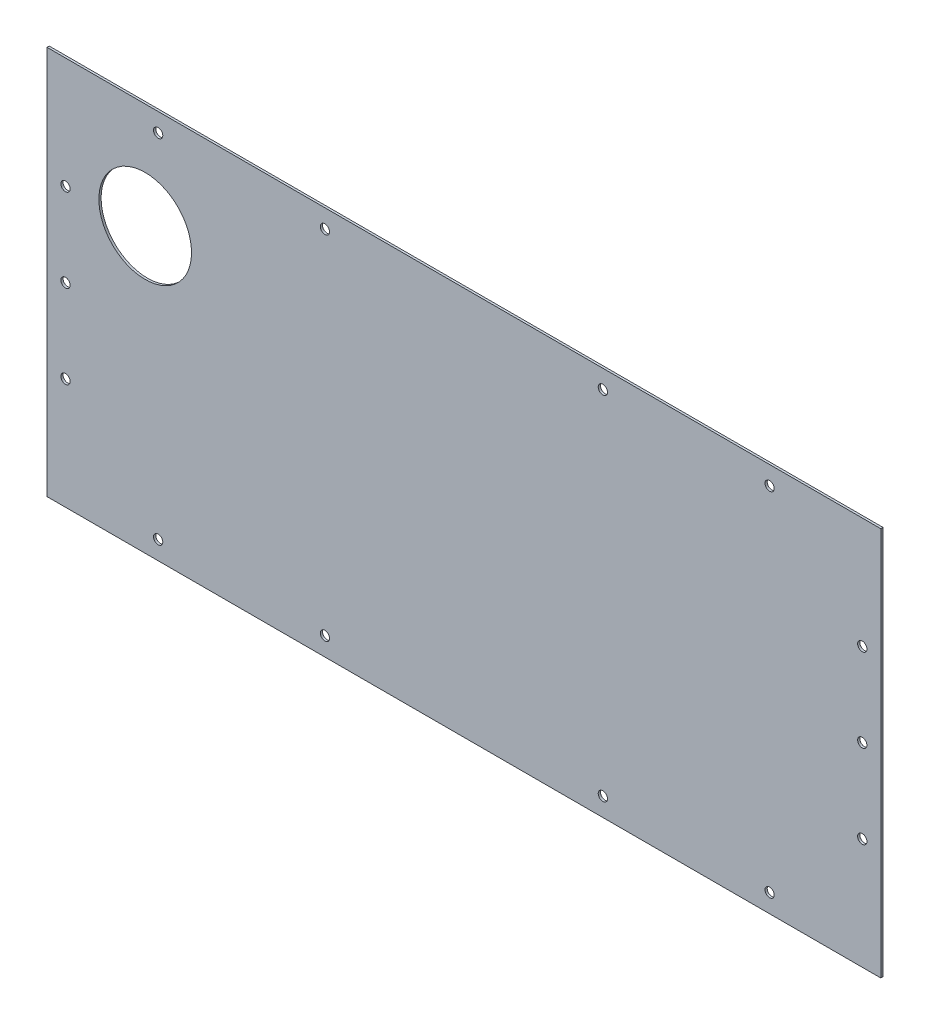
ISO-10303-21;
HEADER;
FILE_DESCRIPTION(('STEP AP214'),'2;1');
FILE_NAME('part.step','',(''),(''),'','','');
FILE_SCHEMA(('AUTOMOTIVE_DESIGN { 1 0 10303 214 1 1 1 1 }'));
ENDSEC;
DATA;
#1=APPLICATION_CONTEXT('core data for automotive mechanical design processes');
#2=APPLICATION_PROTOCOL_DEFINITION('international standard','automotive_design',2000,#1);
#3=PRODUCT_CONTEXT('',#1,'mechanical');
#4=PRODUCT('Part','Part','',(#3));
#5=PRODUCT_RELATED_PRODUCT_CATEGORY('part','',(#4));
#6=PRODUCT_DEFINITION_FORMATION('','',#4);
#7=PRODUCT_DEFINITION_CONTEXT('part definition',#1,'design');
#8=PRODUCT_DEFINITION('design','',#6,#7);
#9=PRODUCT_DEFINITION_SHAPE('','',#8);
#10=(LENGTH_UNIT() NAMED_UNIT(*) SI_UNIT(.MILLI.,.METRE.));
#11=(NAMED_UNIT(*) PLANE_ANGLE_UNIT() SI_UNIT($,.RADIAN.));
#12=(NAMED_UNIT(*) SI_UNIT($,.STERADIAN.) SOLID_ANGLE_UNIT());
#13=UNCERTAINTY_MEASURE_WITH_UNIT(LENGTH_MEASURE(1.E-05),#10,'distance_accuracy_value','');
#14=(GEOMETRIC_REPRESENTATION_CONTEXT(3) GLOBAL_UNCERTAINTY_ASSIGNED_CONTEXT((#13)) GLOBAL_UNIT_ASSIGNED_CONTEXT((#10,
#11,#12)) REPRESENTATION_CONTEXT('',''));
#15=CARTESIAN_POINT('',(0.,0.,0.));
#16=DIRECTION('',(0.,0.,1.));
#17=DIRECTION('',(1.,0.,0.));
#18=AXIS2_PLACEMENT_3D('',#15,#16,#17);
#19=CARTESIAN_POINT('',(0.,0.,0.));
#20=DIRECTION('',(-1.,0.,0.));
#21=DIRECTION('',(0.,1.,0.));
#22=AXIS2_PLACEMENT_3D('',#19,#20,#21);
#23=PLANE('',#22);
#24=DIRECTION('',(0.,0.,-1.));
#25=VECTOR('',#24,1.);
#26=CARTESIAN_POINT('',(0.,0.,0.));
#27=LINE('',#26,#25);
#28=CARTESIAN_POINT('',(0.,0.,0.));
#29=VERTEX_POINT('',#28);
#30=CARTESIAN_POINT('',(0.,0.,-1.2));
#31=VERTEX_POINT('',#30);
#32=EDGE_CURVE('E11',#29,#31,#27,.T.);
#33=ORIENTED_EDGE('',*,*,#32,.F.);
#34=DIRECTION('',(0.,1.,0.));
#35=VECTOR('',#34,1.);
#36=CARTESIAN_POINT('',(0.,0.,0.));
#37=LINE('',#36,#35);
#38=CARTESIAN_POINT('',(0.,210.,0.));
#39=VERTEX_POINT('',#38);
#40=EDGE_CURVE('E96',#29,#39,#37,.T.);
#41=ORIENTED_EDGE('',*,*,#40,.T.);
#42=DIRECTION('',(0.,0.,-1.));
#43=VECTOR('',#42,1.);
#44=CARTESIAN_POINT('',(0.,210.,0.));
#45=LINE('',#44,#43);
#46=CARTESIAN_POINT('',(0.,210.,-1.2));
#47=VERTEX_POINT('',#46);
#48=EDGE_CURVE('E45',#39,#47,#45,.T.);
#49=ORIENTED_EDGE('',*,*,#48,.T.);
#50=DIRECTION('',(0.,1.,0.));
#51=VECTOR('',#50,1.);
#52=CARTESIAN_POINT('',(0.,0.,-1.2));
#53=LINE('',#52,#51);
#54=EDGE_CURVE('E105',#31,#47,#53,.T.);
#55=ORIENTED_EDGE('',*,*,#54,.F.);
#56=EDGE_LOOP('',(#33,#41,#49,#55));
#57=FACE_BOUND('',#56,.T.);
#58=ADVANCED_FACE('F35',(#57),#23,.T.);
#59=CARTESIAN_POINT('',(0.,210.,0.));
#60=DIRECTION('',(0.,1.,0.));
#61=DIRECTION('',(1.,0.,0.));
#62=AXIS2_PLACEMENT_3D('',#59,#60,#61);
#63=PLANE('',#62);
#64=ORIENTED_EDGE('',*,*,#48,.F.);
#65=DIRECTION('',(1.,0.,0.));
#66=VECTOR('',#65,1.);
#67=CARTESIAN_POINT('',(0.,210.,0.));
#68=LINE('',#67,#66);
#69=CARTESIAN_POINT('',(450.,210.,0.));
#70=VERTEX_POINT('',#69);
#71=EDGE_CURVE('E91',#39,#70,#68,.T.);
#72=ORIENTED_EDGE('',*,*,#71,.T.);
#73=DIRECTION('',(0.,0.,-1.));
#74=VECTOR('',#73,1.);
#75=CARTESIAN_POINT('',(450.,210.,0.));
#76=LINE('',#75,#74);
#77=CARTESIAN_POINT('',(450.,210.,-1.2));
#78=VERTEX_POINT('',#77);
#79=EDGE_CURVE('E76',#70,#78,#76,.T.);
#80=ORIENTED_EDGE('',*,*,#79,.T.);
#81=DIRECTION('',(-1.,0.,0.));
#82=VECTOR('',#81,1.);
#83=CARTESIAN_POINT('',(0.,210.,-1.2));
#84=LINE('',#83,#82);
#85=EDGE_CURVE('E107',#47,#78,#84,.F.);
#86=ORIENTED_EDGE('',*,*,#85,.F.);
#87=EDGE_LOOP('',(#64,#72,#80,#86));
#88=FACE_BOUND('',#87,.T.);
#89=ADVANCED_FACE('F95',(#88),#63,.T.);
#90=CARTESIAN_POINT('',(450.,0.,0.));
#91=DIRECTION('',(-1.,0.,0.));
#92=DIRECTION('',(0.,1.,0.));
#93=AXIS2_PLACEMENT_3D('',#90,#91,#92);
#94=PLANE('',#93);
#95=ORIENTED_EDGE('',*,*,#79,.F.);
#96=DIRECTION('',(0.,1.,0.));
#97=VECTOR('',#96,1.);
#98=CARTESIAN_POINT('',(450.,0.,0.));
#99=LINE('',#98,#97);
#100=CARTESIAN_POINT('',(450.,0.,0.));
#101=VERTEX_POINT('',#100);
#102=EDGE_CURVE('E79',#101,#70,#99,.T.);
#103=ORIENTED_EDGE('',*,*,#102,.F.);
#104=DIRECTION('',(0.,0.,-1.));
#105=VECTOR('',#104,1.);
#106=CARTESIAN_POINT('',(450.,0.,0.));
#107=LINE('',#106,#105);
#108=CARTESIAN_POINT('',(450.,0.,-1.2));
#109=VERTEX_POINT('',#108);
#110=EDGE_CURVE('E39',#101,#109,#107,.T.);
#111=ORIENTED_EDGE('',*,*,#110,.T.);
#112=DIRECTION('',(0.,1.,0.));
#113=VECTOR('',#112,1.);
#114=CARTESIAN_POINT('',(450.,0.,-1.2));
#115=LINE('',#114,#113);
#116=EDGE_CURVE('E81',#109,#78,#115,.T.);
#117=ORIENTED_EDGE('',*,*,#116,.T.);
#118=EDGE_LOOP('',(#95,#103,#111,#117));
#119=FACE_BOUND('',#118,.T.);
#120=ADVANCED_FACE('F78',(#119),#94,.F.);
#121=CARTESIAN_POINT('',(0.,0.,0.));
#122=DIRECTION('',(0.,1.,0.));
#123=DIRECTION('',(1.,0.,0.));
#124=AXIS2_PLACEMENT_3D('',#121,#122,#123);
#125=PLANE('',#124);
#126=DIRECTION('',(1.,0.,0.));
#127=VECTOR('',#126,1.);
#128=CARTESIAN_POINT('',(0.,0.,0.));
#129=LINE('',#128,#127);
#130=EDGE_CURVE('E92',#29,#101,#129,.T.);
#131=ORIENTED_EDGE('',*,*,#130,.F.);
#132=ORIENTED_EDGE('',*,*,#32,.T.);
#133=DIRECTION('',(-1.,0.,0.));
#134=VECTOR('',#133,1.);
#135=CARTESIAN_POINT('',(0.,0.,-1.2));
#136=LINE('',#135,#134);
#137=EDGE_CURVE('E98',#31,#109,#136,.F.);
#138=ORIENTED_EDGE('',*,*,#137,.T.);
#139=ORIENTED_EDGE('',*,*,#110,.F.);
#140=EDGE_LOOP('',(#131,#132,#138,#139));
#141=FACE_BOUND('',#140,.T.);
#142=ADVANCED_FACE('F37',(#141),#125,.F.);
#143=CARTESIAN_POINT('',(0.,0.,-1.2));
#144=DIRECTION('',(0.,0.,-1.));
#145=DIRECTION('',(-1.,0.,0.));
#146=AXIS2_PLACEMENT_3D('',#143,#144,#145);
#147=PLANE('',#146);
#148=CARTESIAN_POINT('',(440.,150.,-1.2));
#149=DIRECTION('',(0.,0.,-1.));
#150=DIRECTION('',(-1.,0.,0.));
#151=AXIS2_PLACEMENT_3D('',#148,#149,#150);
#152=CIRCLE('',#151,2.50000000000002);
#153=CARTESIAN_POINT('',(437.5,150.,-1.2));
#154=VERTEX_POINT('',#153);
#155=EDGE_CURVE('E114',#154,#154,#152,.T.);
#156=ORIENTED_EDGE('',*,*,#155,.F.);
#157=EDGE_LOOP('',(#156));
#158=FACE_BOUND('',#157,.T.);
#159=CARTESIAN_POINT('',(60.,200.,-1.2));
#160=DIRECTION('',(0.,0.,-1.));
#161=DIRECTION('',(-1.,0.,0.));
#162=AXIS2_PLACEMENT_3D('',#159,#160,#161);
#163=CIRCLE('',#162,2.5);
#164=CARTESIAN_POINT('',(57.5,200.,-1.2));
#165=VERTEX_POINT('',#164);
#166=EDGE_CURVE('E117',#165,#165,#163,.T.);
#167=ORIENTED_EDGE('',*,*,#166,.F.);
#168=EDGE_LOOP('',(#167));
#169=FACE_BOUND('',#168,.T.);
#170=CARTESIAN_POINT('',(150.,200.,-1.2));
#171=DIRECTION('',(0.,0.,-1.));
#172=DIRECTION('',(-1.,0.,0.));
#173=AXIS2_PLACEMENT_3D('',#170,#171,#172);
#174=CIRCLE('',#173,2.5);
#175=CARTESIAN_POINT('',(147.5,200.,-1.2));
#176=VERTEX_POINT('',#175);
#177=EDGE_CURVE('E120',#176,#176,#174,.T.);
#178=ORIENTED_EDGE('',*,*,#177,.F.);
#179=EDGE_LOOP('',(#178));
#180=FACE_BOUND('',#179,.T.);
#181=CARTESIAN_POINT('',(390.,10.0000000000001,-1.2));
#182=DIRECTION('',(0.,0.,-1.));
#183=DIRECTION('',(-1.,0.,0.));
#184=AXIS2_PLACEMENT_3D('',#181,#182,#183);
#185=CIRCLE('',#184,2.49999999999996);
#186=CARTESIAN_POINT('',(387.5,10.0000000000001,-1.2));
#187=VERTEX_POINT('',#186);
#188=EDGE_CURVE('E123',#187,#187,#185,.T.);
#189=ORIENTED_EDGE('',*,*,#188,.F.);
#190=EDGE_LOOP('',(#189));
#191=FACE_BOUND('',#190,.T.);
#192=CARTESIAN_POINT('',(440.,105.,-1.2));
#193=DIRECTION('',(0.,0.,-1.));
#194=DIRECTION('',(-1.,0.,0.));
#195=AXIS2_PLACEMENT_3D('',#192,#193,#194);
#196=CIRCLE('',#195,2.50000000000002);
#197=CARTESIAN_POINT('',(437.5,105.,-1.2));
#198=VERTEX_POINT('',#197);
#199=EDGE_CURVE('E126',#198,#198,#196,.T.);
#200=ORIENTED_EDGE('',*,*,#199,.F.);
#201=EDGE_LOOP('',(#200));
#202=FACE_BOUND('',#201,.T.);
#203=CARTESIAN_POINT('',(440.,60.0000000000001,-1.2));
#204=DIRECTION('',(0.,0.,-1.));
#205=DIRECTION('',(-1.,0.,0.));
#206=AXIS2_PLACEMENT_3D('',#203,#204,#205);
#207=CIRCLE('',#206,2.50000000000002);
#208=CARTESIAN_POINT('',(437.5,60.0000000000001,-1.2));
#209=VERTEX_POINT('',#208);
#210=EDGE_CURVE('E129',#209,#209,#207,.T.);
#211=ORIENTED_EDGE('',*,*,#210,.F.);
#212=EDGE_LOOP('',(#211));
#213=FACE_BOUND('',#212,.T.);
#214=CARTESIAN_POINT('',(10.,150.,-1.2));
#215=DIRECTION('',(0.,0.,-1.));
#216=DIRECTION('',(-1.,0.,0.));
#217=AXIS2_PLACEMENT_3D('',#214,#215,#216);
#218=CIRCLE('',#217,2.5);
#219=CARTESIAN_POINT('',(7.5,150.,-1.2));
#220=VERTEX_POINT('',#219);
#221=EDGE_CURVE('E132',#220,#220,#218,.T.);
#222=ORIENTED_EDGE('',*,*,#221,.F.);
#223=EDGE_LOOP('',(#222));
#224=FACE_BOUND('',#223,.T.);
#225=CARTESIAN_POINT('',(10.,105.,-1.2));
#226=DIRECTION('',(0.,0.,-1.));
#227=DIRECTION('',(-1.,0.,0.));
#228=AXIS2_PLACEMENT_3D('',#225,#226,#227);
#229=CIRCLE('',#228,2.5);
#230=CARTESIAN_POINT('',(7.5,105.,-1.2));
#231=VERTEX_POINT('',#230);
#232=EDGE_CURVE('E135',#231,#231,#229,.T.);
#233=ORIENTED_EDGE('',*,*,#232,.F.);
#234=EDGE_LOOP('',(#233));
#235=FACE_BOUND('',#234,.T.);
#236=CARTESIAN_POINT('',(300.,200.,-1.2));
#237=DIRECTION('',(0.,0.,-1.));
#238=DIRECTION('',(-1.,0.,0.));
#239=AXIS2_PLACEMENT_3D('',#236,#237,#238);
#240=CIRCLE('',#239,2.50000000000002);
#241=CARTESIAN_POINT('',(297.5,200.,-1.2));
#242=VERTEX_POINT('',#241);
#243=EDGE_CURVE('E138',#242,#242,#240,.T.);
#244=ORIENTED_EDGE('',*,*,#243,.F.);
#245=EDGE_LOOP('',(#244));
#246=FACE_BOUND('',#245,.T.);
#247=CARTESIAN_POINT('',(390.,200.,-1.2));
#248=DIRECTION('',(0.,0.,-1.));
#249=DIRECTION('',(-1.,0.,0.));
#250=AXIS2_PLACEMENT_3D('',#247,#248,#249);
#251=CIRCLE('',#250,2.49999999999996);
#252=CARTESIAN_POINT('',(387.5,200.,-1.2));
#253=VERTEX_POINT('',#252);
#254=EDGE_CURVE('E141',#253,#253,#251,.T.);
#255=ORIENTED_EDGE('',*,*,#254,.F.);
#256=EDGE_LOOP('',(#255));
#257=FACE_BOUND('',#256,.T.);
#258=CARTESIAN_POINT('',(300.,10.0000000000001,-1.2));
#259=DIRECTION('',(0.,0.,-1.));
#260=DIRECTION('',(-1.,0.,0.));
#261=AXIS2_PLACEMENT_3D('',#258,#259,#260);
#262=CIRCLE('',#261,2.50000000000002);
#263=CARTESIAN_POINT('',(297.5,10.0000000000001,-1.2));
#264=VERTEX_POINT('',#263);
#265=EDGE_CURVE('E144',#264,#264,#262,.T.);
#266=ORIENTED_EDGE('',*,*,#265,.F.);
#267=EDGE_LOOP('',(#266));
#268=FACE_BOUND('',#267,.T.);
#269=CARTESIAN_POINT('',(150.,10.,-1.2));
#270=DIRECTION('',(0.,0.,-1.));
#271=DIRECTION('',(-1.,0.,0.));
#272=AXIS2_PLACEMENT_3D('',#269,#270,#271);
#273=CIRCLE('',#272,2.5);
#274=CARTESIAN_POINT('',(147.5,10.,-1.2));
#275=VERTEX_POINT('',#274);
#276=EDGE_CURVE('E147',#275,#275,#273,.T.);
#277=ORIENTED_EDGE('',*,*,#276,.F.);
#278=EDGE_LOOP('',(#277));
#279=FACE_BOUND('',#278,.T.);
#280=CARTESIAN_POINT('',(60.,10.,-1.2));
#281=DIRECTION('',(0.,0.,-1.));
#282=DIRECTION('',(-1.,0.,0.));
#283=AXIS2_PLACEMENT_3D('',#280,#281,#282);
#284=CIRCLE('',#283,2.5);
#285=CARTESIAN_POINT('',(57.5,10.,-1.2));
#286=VERTEX_POINT('',#285);
#287=EDGE_CURVE('E150',#286,#286,#284,.T.);
#288=ORIENTED_EDGE('',*,*,#287,.F.);
#289=EDGE_LOOP('',(#288));
#290=FACE_BOUND('',#289,.T.);
#291=CARTESIAN_POINT('',(10.,60.,-1.2));
#292=DIRECTION('',(0.,0.,-1.));
#293=DIRECTION('',(-1.,0.,0.));
#294=AXIS2_PLACEMENT_3D('',#291,#292,#293);
#295=CIRCLE('',#294,2.5);
#296=CARTESIAN_POINT('',(7.5,60.,-1.2));
#297=VERTEX_POINT('',#296);
#298=EDGE_CURVE('E153',#297,#297,#295,.T.);
#299=ORIENTED_EDGE('',*,*,#298,.F.);
#300=EDGE_LOOP('',(#299));
#301=FACE_BOUND('',#300,.T.);
#302=CARTESIAN_POINT('',(53.,153.,-1.2));
#303=DIRECTION('',(0.,0.,-1.));
#304=DIRECTION('',(-1.,0.,0.));
#305=AXIS2_PLACEMENT_3D('',#302,#303,#304);
#306=CIRCLE('',#305,25.);
#307=CARTESIAN_POINT('',(28.,153.,-1.2));
#308=VERTEX_POINT('',#307);
#309=EDGE_CURVE('E93',#308,#308,#306,.T.);
#310=ORIENTED_EDGE('',*,*,#309,.F.);
#311=EDGE_LOOP('',(#310));
#312=FACE_BOUND('',#311,.T.);
#313=ORIENTED_EDGE('',*,*,#116,.F.);
#314=ORIENTED_EDGE('',*,*,#137,.F.);
#315=ORIENTED_EDGE('',*,*,#54,.T.);
#316=ORIENTED_EDGE('',*,*,#85,.T.);
#317=EDGE_LOOP('',(#313,#314,#315,#316));
#318=FACE_BOUND('',#317,.T.);
#319=ADVANCED_FACE('F204',(#158,#169,#180,#191,#202,#213,#224,#235,#246,#257,#268,#279,#290,
#301,#312,#318),#147,.T.);
#320=CARTESIAN_POINT('',(0.,0.,0.));
#321=DIRECTION('',(0.,0.,-1.));
#322=DIRECTION('',(-1.,0.,0.));
#323=AXIS2_PLACEMENT_3D('',#320,#321,#322);
#324=PLANE('',#323);
#325=CARTESIAN_POINT('',(440.,150.,0.));
#326=DIRECTION('',(0.,0.,1.));
#327=DIRECTION('',(-1.,0.,0.));
#328=AXIS2_PLACEMENT_3D('',#325,#326,#327);
#329=CIRCLE('',#328,2.50000000000002);
#330=CARTESIAN_POINT('',(437.5,150.,0.));
#331=VERTEX_POINT('',#330);
#332=EDGE_CURVE('E164',#331,#331,#329,.T.);
#333=ORIENTED_EDGE('',*,*,#332,.F.);
#334=EDGE_LOOP('',(#333));
#335=FACE_BOUND('',#334,.T.);
#336=CARTESIAN_POINT('',(60.,200.,0.));
#337=DIRECTION('',(0.,0.,1.));
#338=DIRECTION('',(1.,0.,0.));
#339=AXIS2_PLACEMENT_3D('',#336,#337,#338);
#340=CIRCLE('',#339,2.5);
#341=CARTESIAN_POINT('',(62.5,200.,0.));
#342=VERTEX_POINT('',#341);
#343=EDGE_CURVE('E172',#342,#342,#340,.T.);
#344=ORIENTED_EDGE('',*,*,#343,.F.);
#345=EDGE_LOOP('',(#344));
#346=FACE_BOUND('',#345,.T.);
#347=CARTESIAN_POINT('',(150.,200.,0.));
#348=DIRECTION('',(0.,0.,1.));
#349=DIRECTION('',(1.,0.,0.));
#350=AXIS2_PLACEMENT_3D('',#347,#348,#349);
#351=CIRCLE('',#350,2.5);
#352=CARTESIAN_POINT('',(152.5,200.,0.));
#353=VERTEX_POINT('',#352);
#354=EDGE_CURVE('E175',#353,#353,#351,.T.);
#355=ORIENTED_EDGE('',*,*,#354,.F.);
#356=EDGE_LOOP('',(#355));
#357=FACE_BOUND('',#356,.T.);
#358=CARTESIAN_POINT('',(390.,10.0000000000001,0.));
#359=DIRECTION('',(0.,0.,1.));
#360=DIRECTION('',(1.,0.,0.));
#361=AXIS2_PLACEMENT_3D('',#358,#359,#360);
#362=CIRCLE('',#361,2.49999999999996);
#363=CARTESIAN_POINT('',(392.5,10.0000000000001,0.));
#364=VERTEX_POINT('',#363);
#365=EDGE_CURVE('E178',#364,#364,#362,.T.);
#366=ORIENTED_EDGE('',*,*,#365,.F.);
#367=EDGE_LOOP('',(#366));
#368=FACE_BOUND('',#367,.T.);
#369=CARTESIAN_POINT('',(440.,105.,0.));
#370=DIRECTION('',(0.,0.,1.));
#371=DIRECTION('',(-1.,0.,0.));
#372=AXIS2_PLACEMENT_3D('',#369,#370,#371);
#373=CIRCLE('',#372,2.50000000000002);
#374=CARTESIAN_POINT('',(437.5,105.,0.));
#375=VERTEX_POINT('',#374);
#376=EDGE_CURVE('E160',#375,#375,#373,.T.);
#377=ORIENTED_EDGE('',*,*,#376,.F.);
#378=EDGE_LOOP('',(#377));
#379=FACE_BOUND('',#378,.T.);
#380=CARTESIAN_POINT('',(440.,60.0000000000001,0.));
#381=DIRECTION('',(0.,0.,1.));
#382=DIRECTION('',(-1.,0.,0.));
#383=AXIS2_PLACEMENT_3D('',#380,#381,#382);
#384=CIRCLE('',#383,2.50000000000002);
#385=CARTESIAN_POINT('',(437.5,60.0000000000001,0.));
#386=VERTEX_POINT('',#385);
#387=EDGE_CURVE('E163',#386,#386,#384,.T.);
#388=ORIENTED_EDGE('',*,*,#387,.F.);
#389=EDGE_LOOP('',(#388));
#390=FACE_BOUND('',#389,.T.);
#391=CARTESIAN_POINT('',(10.,150.,0.));
#392=DIRECTION('',(0.,0.,1.));
#393=DIRECTION('',(1.,0.,0.));
#394=AXIS2_PLACEMENT_3D('',#391,#392,#393);
#395=CIRCLE('',#394,2.5);
#396=CARTESIAN_POINT('',(12.5,150.,0.));
#397=VERTEX_POINT('',#396);
#398=EDGE_CURVE('E167',#397,#397,#395,.T.);
#399=ORIENTED_EDGE('',*,*,#398,.F.);
#400=EDGE_LOOP('',(#399));
#401=FACE_BOUND('',#400,.T.);
#402=CARTESIAN_POINT('',(10.,105.,0.));
#403=DIRECTION('',(0.,0.,1.));
#404=DIRECTION('',(1.,0.,0.));
#405=AXIS2_PLACEMENT_3D('',#402,#403,#404);
#406=CIRCLE('',#405,2.5);
#407=CARTESIAN_POINT('',(12.5,105.,0.));
#408=VERTEX_POINT('',#407);
#409=EDGE_CURVE('E159',#408,#408,#406,.T.);
#410=ORIENTED_EDGE('',*,*,#409,.F.);
#411=EDGE_LOOP('',(#410));
#412=FACE_BOUND('',#411,.T.);
#413=CARTESIAN_POINT('',(300.,200.,0.));
#414=DIRECTION('',(0.,0.,1.));
#415=DIRECTION('',(-1.,0.,0.));
#416=AXIS2_PLACEMENT_3D('',#413,#414,#415);
#417=CIRCLE('',#416,2.50000000000002);
#418=CARTESIAN_POINT('',(297.5,200.,0.));
#419=VERTEX_POINT('',#418);
#420=EDGE_CURVE('E181',#419,#419,#417,.T.);
#421=ORIENTED_EDGE('',*,*,#420,.F.);
#422=EDGE_LOOP('',(#421));
#423=FACE_BOUND('',#422,.T.);
#424=CARTESIAN_POINT('',(390.,200.,0.));
#425=DIRECTION('',(0.,0.,1.));
#426=DIRECTION('',(-1.,0.,0.));
#427=AXIS2_PLACEMENT_3D('',#424,#425,#426);
#428=CIRCLE('',#427,2.49999999999996);
#429=CARTESIAN_POINT('',(387.5,200.,0.));
#430=VERTEX_POINT('',#429);
#431=EDGE_CURVE('E193',#430,#430,#428,.T.);
#432=ORIENTED_EDGE('',*,*,#431,.F.);
#433=EDGE_LOOP('',(#432));
#434=FACE_BOUND('',#433,.T.);
#435=CARTESIAN_POINT('',(300.,10.0000000000001,0.));
#436=DIRECTION('',(0.,0.,1.));
#437=DIRECTION('',(1.,0.,0.));
#438=AXIS2_PLACEMENT_3D('',#435,#436,#437);
#439=CIRCLE('',#438,2.50000000000002);
#440=CARTESIAN_POINT('',(302.5,10.0000000000001,0.));
#441=VERTEX_POINT('',#440);
#442=EDGE_CURVE('E190',#441,#441,#439,.T.);
#443=ORIENTED_EDGE('',*,*,#442,.F.);
#444=EDGE_LOOP('',(#443));
#445=FACE_BOUND('',#444,.T.);
#446=CARTESIAN_POINT('',(150.,10.,0.));
#447=DIRECTION('',(0.,0.,1.));
#448=DIRECTION('',(-1.,0.,0.));
#449=AXIS2_PLACEMENT_3D('',#446,#447,#448);
#450=CIRCLE('',#449,2.5);
#451=CARTESIAN_POINT('',(147.5,10.,0.));
#452=VERTEX_POINT('',#451);
#453=EDGE_CURVE('E187',#452,#452,#450,.T.);
#454=ORIENTED_EDGE('',*,*,#453,.F.);
#455=EDGE_LOOP('',(#454));
#456=FACE_BOUND('',#455,.T.);
#457=CARTESIAN_POINT('',(60.,10.,0.));
#458=DIRECTION('',(0.,0.,1.));
#459=DIRECTION('',(-1.,0.,0.));
#460=AXIS2_PLACEMENT_3D('',#457,#458,#459);
#461=CIRCLE('',#460,2.5);
#462=CARTESIAN_POINT('',(57.5,10.,0.));
#463=VERTEX_POINT('',#462);
#464=EDGE_CURVE('E184',#463,#463,#461,.T.);
#465=ORIENTED_EDGE('',*,*,#464,.F.);
#466=EDGE_LOOP('',(#465));
#467=FACE_BOUND('',#466,.T.);
#468=CARTESIAN_POINT('',(10.,60.,0.));
#469=DIRECTION('',(0.,0.,1.));
#470=DIRECTION('',(1.,0.,0.));
#471=AXIS2_PLACEMENT_3D('',#468,#469,#470);
#472=CIRCLE('',#471,2.5);
#473=CARTESIAN_POINT('',(12.5,60.,0.));
#474=VERTEX_POINT('',#473);
#475=EDGE_CURVE('E156',#474,#474,#472,.T.);
#476=ORIENTED_EDGE('',*,*,#475,.F.);
#477=EDGE_LOOP('',(#476));
#478=FACE_BOUND('',#477,.T.);
#479=CARTESIAN_POINT('',(53.,153.,0.));
#480=DIRECTION('',(0.,0.,1.));
#481=DIRECTION('',(1.,0.,0.));
#482=AXIS2_PLACEMENT_3D('',#479,#480,#481);
#483=CIRCLE('',#482,25.);
#484=CARTESIAN_POINT('',(78.,153.,0.));
#485=VERTEX_POINT('',#484);
#486=EDGE_CURVE('E111',#485,#485,#483,.T.);
#487=ORIENTED_EDGE('',*,*,#486,.F.);
#488=EDGE_LOOP('',(#487));
#489=FACE_BOUND('',#488,.T.);
#490=ORIENTED_EDGE('',*,*,#102,.T.);
#491=ORIENTED_EDGE('',*,*,#71,.F.);
#492=ORIENTED_EDGE('',*,*,#40,.F.);
#493=ORIENTED_EDGE('',*,*,#130,.T.);
#494=EDGE_LOOP('',(#490,#491,#492,#493));
#495=FACE_BOUND('',#494,.T.);
#496=ADVANCED_FACE('F89',(#335,#346,#357,#368,#379,#390,#401,#412,#423,#434,#445,#456,#467,#478,
#489,#495),#324,.F.);
#497=CARTESIAN_POINT('',(53.,153.,-10.));
#498=DIRECTION('',(0.,0.,1.));
#499=DIRECTION('',(1.,0.,0.));
#500=AXIS2_PLACEMENT_3D('',#497,#498,#499);
#501=CYLINDRICAL_SURFACE('',#500,25.);
#502=ORIENTED_EDGE('',*,*,#309,.T.);
#503=EDGE_LOOP('',(#502));
#504=FACE_BOUND('',#503,.T.);
#505=ORIENTED_EDGE('',*,*,#486,.T.);
#506=EDGE_LOOP('',(#505));
#507=FACE_BOUND('',#506,.T.);
#508=ADVANCED_FACE('F203',(#504,#507),#501,.F.);
#509=CARTESIAN_POINT('',(10.,60.,-10.));
#510=DIRECTION('',(0.,0.,1.));
#511=DIRECTION('',(1.,0.,0.));
#512=AXIS2_PLACEMENT_3D('',#509,#510,#511);
#513=CYLINDRICAL_SURFACE('',#512,2.5);
#514=ORIENTED_EDGE('',*,*,#298,.T.);
#515=EDGE_LOOP('',(#514));
#516=FACE_BOUND('',#515,.T.);
#517=ORIENTED_EDGE('',*,*,#475,.T.);
#518=EDGE_LOOP('',(#517));
#519=FACE_BOUND('',#518,.T.);
#520=ADVANCED_FACE('F220',(#516,#519),#513,.F.);
#521=CARTESIAN_POINT('',(60.,10.,-10.));
#522=DIRECTION('',(0.,0.,1.));
#523=DIRECTION('',(1.,0.,0.));
#524=AXIS2_PLACEMENT_3D('',#521,#522,#523);
#525=CYLINDRICAL_SURFACE('',#524,2.5);
#526=ORIENTED_EDGE('',*,*,#287,.T.);
#527=EDGE_LOOP('',(#526));
#528=FACE_BOUND('',#527,.T.);
#529=ORIENTED_EDGE('',*,*,#464,.T.);
#530=EDGE_LOOP('',(#529));
#531=FACE_BOUND('',#530,.T.);
#532=ADVANCED_FACE('F226',(#528,#531),#525,.F.);
#533=CARTESIAN_POINT('',(150.,10.,-10.));
#534=DIRECTION('',(0.,0.,1.));
#535=DIRECTION('',(1.,0.,0.));
#536=AXIS2_PLACEMENT_3D('',#533,#534,#535);
#537=CYLINDRICAL_SURFACE('',#536,2.5);
#538=ORIENTED_EDGE('',*,*,#276,.T.);
#539=EDGE_LOOP('',(#538));
#540=FACE_BOUND('',#539,.T.);
#541=ORIENTED_EDGE('',*,*,#453,.T.);
#542=EDGE_LOOP('',(#541));
#543=FACE_BOUND('',#542,.T.);
#544=ADVANCED_FACE('F277',(#540,#543),#537,.F.);
#545=CARTESIAN_POINT('',(300.,10.0000000000001,-10.));
#546=DIRECTION('',(0.,0.,1.));
#547=DIRECTION('',(1.,0.,0.));
#548=AXIS2_PLACEMENT_3D('',#545,#546,#547);
#549=CYLINDRICAL_SURFACE('',#548,2.50000000000002);
#550=ORIENTED_EDGE('',*,*,#265,.T.);
#551=EDGE_LOOP('',(#550));
#552=FACE_BOUND('',#551,.T.);
#553=ORIENTED_EDGE('',*,*,#442,.T.);
#554=EDGE_LOOP('',(#553));
#555=FACE_BOUND('',#554,.T.);
#556=ADVANCED_FACE('F282',(#552,#555),#549,.F.);
#557=CARTESIAN_POINT('',(390.,200.,-10.));
#558=DIRECTION('',(0.,0.,1.));
#559=DIRECTION('',(1.,0.,0.));
#560=AXIS2_PLACEMENT_3D('',#557,#558,#559);
#561=CYLINDRICAL_SURFACE('',#560,2.49999999999996);
#562=ORIENTED_EDGE('',*,*,#254,.T.);
#563=EDGE_LOOP('',(#562));
#564=FACE_BOUND('',#563,.T.);
#565=ORIENTED_EDGE('',*,*,#431,.T.);
#566=EDGE_LOOP('',(#565));
#567=FACE_BOUND('',#566,.T.);
#568=ADVANCED_FACE('F382',(#564,#567),#561,.F.);
#569=CARTESIAN_POINT('',(300.,200.,-10.));
#570=DIRECTION('',(0.,0.,1.));
#571=DIRECTION('',(1.,0.,0.));
#572=AXIS2_PLACEMENT_3D('',#569,#570,#571);
#573=CYLINDRICAL_SURFACE('',#572,2.50000000000002);
#574=ORIENTED_EDGE('',*,*,#243,.T.);
#575=EDGE_LOOP('',(#574));
#576=FACE_BOUND('',#575,.T.);
#577=ORIENTED_EDGE('',*,*,#420,.T.);
#578=EDGE_LOOP('',(#577));
#579=FACE_BOUND('',#578,.T.);
#580=ADVANCED_FACE('F199',(#576,#579),#573,.F.);
#581=CARTESIAN_POINT('',(10.,105.,-10.));
#582=DIRECTION('',(0.,0.,1.));
#583=DIRECTION('',(1.,0.,0.));
#584=AXIS2_PLACEMENT_3D('',#581,#582,#583);
#585=CYLINDRICAL_SURFACE('',#584,2.5);
#586=ORIENTED_EDGE('',*,*,#232,.T.);
#587=EDGE_LOOP('',(#586));
#588=FACE_BOUND('',#587,.T.);
#589=ORIENTED_EDGE('',*,*,#409,.T.);
#590=EDGE_LOOP('',(#589));
#591=FACE_BOUND('',#590,.T.);
#592=ADVANCED_FACE('F304',(#588,#591),#585,.F.);
#593=CARTESIAN_POINT('',(10.,150.,-10.));
#594=DIRECTION('',(0.,0.,1.));
#595=DIRECTION('',(1.,0.,0.));
#596=AXIS2_PLACEMENT_3D('',#593,#594,#595);
#597=CYLINDRICAL_SURFACE('',#596,2.5);
#598=ORIENTED_EDGE('',*,*,#221,.T.);
#599=EDGE_LOOP('',(#598));
#600=FACE_BOUND('',#599,.T.);
#601=ORIENTED_EDGE('',*,*,#398,.T.);
#602=EDGE_LOOP('',(#601));
#603=FACE_BOUND('',#602,.T.);
#604=ADVANCED_FACE('F307',(#600,#603),#597,.F.);
#605=CARTESIAN_POINT('',(440.,60.0000000000001,-10.));
#606=DIRECTION('',(0.,0.,1.));
#607=DIRECTION('',(1.,0.,0.));
#608=AXIS2_PLACEMENT_3D('',#605,#606,#607);
#609=CYLINDRICAL_SURFACE('',#608,2.50000000000002);
#610=ORIENTED_EDGE('',*,*,#210,.T.);
#611=EDGE_LOOP('',(#610));
#612=FACE_BOUND('',#611,.T.);
#613=ORIENTED_EDGE('',*,*,#387,.T.);
#614=EDGE_LOOP('',(#613));
#615=FACE_BOUND('',#614,.T.);
#616=ADVANCED_FACE('F311',(#612,#615),#609,.F.);
#617=CARTESIAN_POINT('',(440.,105.,-10.));
#618=DIRECTION('',(0.,0.,1.));
#619=DIRECTION('',(1.,0.,0.));
#620=AXIS2_PLACEMENT_3D('',#617,#618,#619);
#621=CYLINDRICAL_SURFACE('',#620,2.50000000000002);
#622=ORIENTED_EDGE('',*,*,#199,.T.);
#623=EDGE_LOOP('',(#622));
#624=FACE_BOUND('',#623,.T.);
#625=ORIENTED_EDGE('',*,*,#376,.T.);
#626=EDGE_LOOP('',(#625));
#627=FACE_BOUND('',#626,.T.);
#628=ADVANCED_FACE('F295',(#624,#627),#621,.F.);
#629=CARTESIAN_POINT('',(390.,10.0000000000001,-10.));
#630=DIRECTION('',(0.,0.,1.));
#631=DIRECTION('',(1.,0.,0.));
#632=AXIS2_PLACEMENT_3D('',#629,#630,#631);
#633=CYLINDRICAL_SURFACE('',#632,2.49999999999996);
#634=ORIENTED_EDGE('',*,*,#188,.T.);
#635=EDGE_LOOP('',(#634));
#636=FACE_BOUND('',#635,.T.);
#637=ORIENTED_EDGE('',*,*,#365,.T.);
#638=EDGE_LOOP('',(#637));
#639=FACE_BOUND('',#638,.T.);
#640=ADVANCED_FACE('F291',(#636,#639),#633,.F.);
#641=CARTESIAN_POINT('',(150.,200.,-10.));
#642=DIRECTION('',(0.,0.,1.));
#643=DIRECTION('',(1.,0.,0.));
#644=AXIS2_PLACEMENT_3D('',#641,#642,#643);
#645=CYLINDRICAL_SURFACE('',#644,2.5);
#646=ORIENTED_EDGE('',*,*,#177,.T.);
#647=EDGE_LOOP('',(#646));
#648=FACE_BOUND('',#647,.T.);
#649=ORIENTED_EDGE('',*,*,#354,.T.);
#650=EDGE_LOOP('',(#649));
#651=FACE_BOUND('',#650,.T.);
#652=ADVANCED_FACE('F287',(#648,#651),#645,.F.);
#653=CARTESIAN_POINT('',(60.,200.,-10.));
#654=DIRECTION('',(0.,0.,1.));
#655=DIRECTION('',(1.,0.,0.));
#656=AXIS2_PLACEMENT_3D('',#653,#654,#655);
#657=CYLINDRICAL_SURFACE('',#656,2.5);
#658=ORIENTED_EDGE('',*,*,#166,.T.);
#659=EDGE_LOOP('',(#658));
#660=FACE_BOUND('',#659,.T.);
#661=ORIENTED_EDGE('',*,*,#343,.T.);
#662=EDGE_LOOP('',(#661));
#663=FACE_BOUND('',#662,.T.);
#664=ADVANCED_FACE('F290',(#660,#663),#657,.F.);
#665=CARTESIAN_POINT('',(440.,150.,-10.));
#666=DIRECTION('',(0.,0.,1.));
#667=DIRECTION('',(1.,0.,0.));
#668=AXIS2_PLACEMENT_3D('',#665,#666,#667);
#669=CYLINDRICAL_SURFACE('',#668,2.50000000000002);
#670=ORIENTED_EDGE('',*,*,#155,.T.);
#671=EDGE_LOOP('',(#670));
#672=FACE_BOUND('',#671,.T.);
#673=ORIENTED_EDGE('',*,*,#332,.T.);
#674=EDGE_LOOP('',(#673));
#675=FACE_BOUND('',#674,.T.);
#676=ADVANCED_FACE('F297',(#672,#675),#669,.F.);
#677=CLOSED_SHELL('',(#58,#89,#120,#142,#319,#496,#508,#520,#532,#544,#556,#568,#580,#592,#604,
#616,#628,#640,#652,#664,#676));
#678=MANIFOLD_SOLID_BREP('B2',#677);
#679=ADVANCED_BREP_SHAPE_REPRESENTATION('',(#18,#678),#14);
#680=SHAPE_DEFINITION_REPRESENTATION(#9,#679);
ENDSEC;
END-ISO-10303-21;
